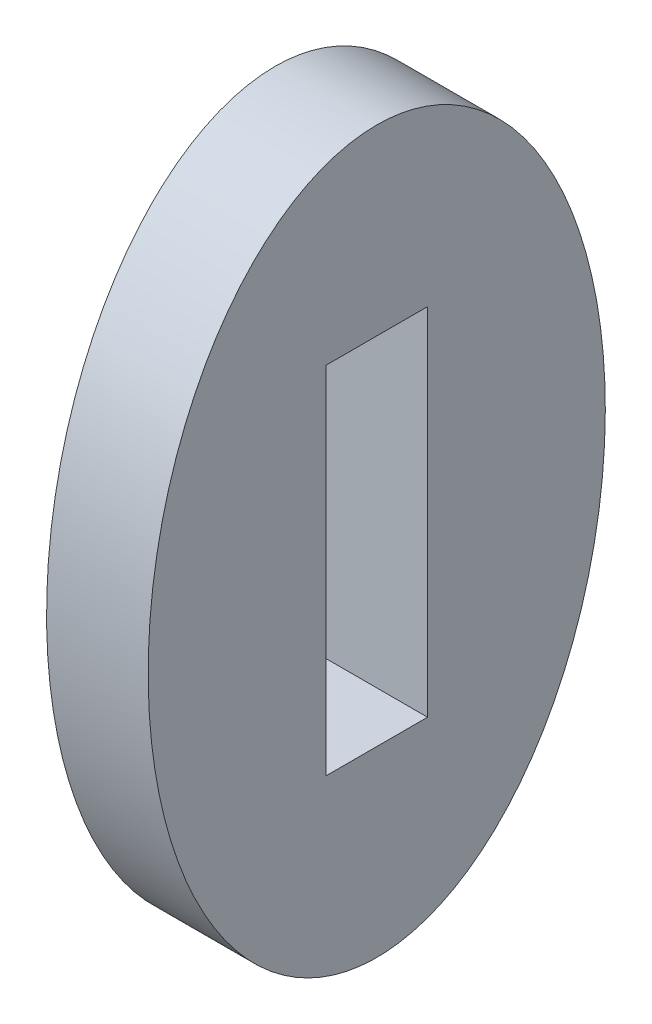
ISO-10303-21;
HEADER;
FILE_DESCRIPTION(('STEP AP214'),'2;1');
FILE_NAME('part.step','',(''),(''),'','','');
FILE_SCHEMA(('AUTOMOTIVE_DESIGN { 1 0 10303 214 1 1 1 1 }'));
ENDSEC;
DATA;
#1=APPLICATION_CONTEXT('core data for automotive mechanical design processes');
#2=APPLICATION_PROTOCOL_DEFINITION('international standard','automotive_design',2000,#1);
#3=PRODUCT_CONTEXT('',#1,'mechanical');
#4=PRODUCT('Part','Part','',(#3));
#5=PRODUCT_RELATED_PRODUCT_CATEGORY('part','',(#4));
#6=PRODUCT_DEFINITION_FORMATION('','',#4);
#7=PRODUCT_DEFINITION_CONTEXT('part definition',#1,'design');
#8=PRODUCT_DEFINITION('design','',#6,#7);
#9=PRODUCT_DEFINITION_SHAPE('','',#8);
#10=(LENGTH_UNIT() NAMED_UNIT(*) SI_UNIT(.MILLI.,.METRE.));
#11=(NAMED_UNIT(*) PLANE_ANGLE_UNIT() SI_UNIT($,.RADIAN.));
#12=(NAMED_UNIT(*) SI_UNIT($,.STERADIAN.) SOLID_ANGLE_UNIT());
#13=UNCERTAINTY_MEASURE_WITH_UNIT(LENGTH_MEASURE(1.E-05),#10,'distance_accuracy_value','');
#14=(GEOMETRIC_REPRESENTATION_CONTEXT(3) GLOBAL_UNCERTAINTY_ASSIGNED_CONTEXT((#13)) GLOBAL_UNIT_ASSIGNED_CONTEXT((#10,
#11,#12)) REPRESENTATION_CONTEXT('',''));
#15=CARTESIAN_POINT('',(0.,0.,0.));
#16=DIRECTION('',(0.,0.,1.));
#17=DIRECTION('',(1.,0.,0.));
#18=AXIS2_PLACEMENT_3D('',#15,#16,#17);
#19=CARTESIAN_POINT('',(6.35,0.,0.));
#20=DIRECTION('',(1.,0.,0.));
#21=DIRECTION('',(0.,0.,-1.));
#22=AXIS2_PLACEMENT_3D('',#19,#20,#21);
#23=PLANE('',#22);
#24=CARTESIAN_POINT('',(6.35,0.,0.));
#25=DIRECTION('',(1.,0.,0.));
#26=DIRECTION('',(0.,1.,0.));
#27=AXIS2_PLACEMENT_3D('',#24,#25,#26);
#28=ELLIPSE('',#27,22.536539576696,14.2875);
#29=CARTESIAN_POINT('',(6.35,22.536539576696,0.));
#30=VERTEX_POINT('',#29);
#31=EDGE_CURVE('E11',#30,#30,#28,.T.);
#32=ORIENTED_EDGE('',*,*,#31,.T.);
#33=EDGE_LOOP('',(#32));
#34=FACE_BOUND('',#33,.T.);
#35=DIRECTION('',(0.,0.,1.));
#36=VECTOR('',#35,1.);
#37=CARTESIAN_POINT('',(6.35,11.1125,3.175));
#38=LINE('',#37,#36);
#39=CARTESIAN_POINT('',(6.35,11.1125,-3.175));
#40=VERTEX_POINT('',#39);
#41=CARTESIAN_POINT('',(6.35,11.1125,3.175));
#42=VERTEX_POINT('',#41);
#43=EDGE_CURVE('E86',#40,#42,#38,.T.);
#44=ORIENTED_EDGE('',*,*,#43,.F.);
#45=DIRECTION('',(0.,1.,0.));
#46=VECTOR('',#45,1.);
#47=CARTESIAN_POINT('',(6.35,-11.1125,-3.175));
#48=LINE('',#47,#46);
#49=CARTESIAN_POINT('',(6.35,-11.1125,-3.175));
#50=VERTEX_POINT('',#49);
#51=EDGE_CURVE('E78',#50,#40,#48,.T.);
#52=ORIENTED_EDGE('',*,*,#51,.F.);
#53=DIRECTION('',(0.,0.,-1.));
#54=VECTOR('',#53,1.);
#55=CARTESIAN_POINT('',(6.35,-11.1125,3.175));
#56=LINE('',#55,#54);
#57=CARTESIAN_POINT('',(6.35,-11.1125,3.175));
#58=VERTEX_POINT('',#57);
#59=EDGE_CURVE('E99',#58,#50,#56,.T.);
#60=ORIENTED_EDGE('',*,*,#59,.F.);
#61=DIRECTION('',(0.,-1.,0.));
#62=VECTOR('',#61,1.);
#63=CARTESIAN_POINT('',(6.35,-11.1125,3.175));
#64=LINE('',#63,#62);
#65=EDGE_CURVE('E97',#42,#58,#64,.T.);
#66=ORIENTED_EDGE('',*,*,#65,.F.);
#67=EDGE_LOOP('',(#44,#52,#60,#66));
#68=FACE_BOUND('',#67,.T.);
#69=ADVANCED_FACE('F37',(#34,#68),#23,.T.);
#70=CARTESIAN_POINT('',(0.,0.,0.));
#71=DIRECTION('',(1.,0.,0.));
#72=DIRECTION('',(0.,0.,-1.));
#73=AXIS2_PLACEMENT_3D('',#70,#71,#72);
#74=PLANE('',#73);
#75=CARTESIAN_POINT('',(0.,0.,0.));
#76=DIRECTION('',(1.,0.,0.));
#77=DIRECTION('',(0.,1.,0.));
#78=AXIS2_PLACEMENT_3D('',#75,#76,#77);
#79=ELLIPSE('',#78,22.536539576696,14.2875);
#80=CARTESIAN_POINT('',(0.,22.536539576696,0.));
#81=VERTEX_POINT('',#80);
#82=EDGE_CURVE('E42',#81,#81,#79,.T.);
#83=ORIENTED_EDGE('',*,*,#82,.F.);
#84=EDGE_LOOP('',(#83));
#85=FACE_BOUND('',#84,.T.);
#86=DIRECTION('',(0.,1.,0.));
#87=VECTOR('',#86,1.);
#88=CARTESIAN_POINT('',(0.,-11.1125,-3.175));
#89=LINE('',#88,#87);
#90=CARTESIAN_POINT('',(0.,-11.1125,-3.175));
#91=VERTEX_POINT('',#90);
#92=CARTESIAN_POINT('',(0.,11.1125,-3.175));
#93=VERTEX_POINT('',#92);
#94=EDGE_CURVE('E60',#91,#93,#89,.T.);
#95=ORIENTED_EDGE('',*,*,#94,.T.);
#96=DIRECTION('',(0.,0.,1.));
#97=VECTOR('',#96,1.);
#98=CARTESIAN_POINT('',(0.,11.1125,3.175));
#99=LINE('',#98,#97);
#100=CARTESIAN_POINT('',(0.,11.1125,3.175));
#101=VERTEX_POINT('',#100);
#102=EDGE_CURVE('E93',#93,#101,#99,.T.);
#103=ORIENTED_EDGE('',*,*,#102,.T.);
#104=DIRECTION('',(0.,-1.,0.));
#105=VECTOR('',#104,1.);
#106=CARTESIAN_POINT('',(0.,-11.1125,3.175));
#107=LINE('',#106,#105);
#108=CARTESIAN_POINT('',(0.,-11.1125,3.175));
#109=VERTEX_POINT('',#108);
#110=EDGE_CURVE('E105',#101,#109,#107,.T.);
#111=ORIENTED_EDGE('',*,*,#110,.T.);
#112=DIRECTION('',(0.,0.,-1.));
#113=VECTOR('',#112,1.);
#114=CARTESIAN_POINT('',(0.,-11.1125,3.175));
#115=LINE('',#114,#113);
#116=EDGE_CURVE('E87',#109,#91,#115,.T.);
#117=ORIENTED_EDGE('',*,*,#116,.T.);
#118=EDGE_LOOP('',(#95,#103,#111,#117));
#119=FACE_BOUND('',#118,.T.);
#120=ADVANCED_FACE('F117',(#85,#119),#74,.F.);
#121=DIRECTION('',(-1.,0.,0.));
#122=VECTOR('',#121,1.);
#123=SURFACE_OF_LINEAR_EXTRUSION('',#28,#122);
#124=ORIENTED_EDGE('',*,*,#31,.F.);
#125=EDGE_LOOP('',(#124));
#126=FACE_BOUND('',#125,.T.);
#127=ORIENTED_EDGE('',*,*,#82,.T.);
#128=EDGE_LOOP('',(#127));
#129=FACE_BOUND('',#128,.T.);
#130=ADVANCED_FACE('F39',(#126,#129),#123,.F.);
#131=CARTESIAN_POINT('',(6.35,-11.1125,-3.175));
#132=DIRECTION('',(0.,0.,1.));
#133=DIRECTION('',(1.,0.,0.));
#134=AXIS2_PLACEMENT_3D('',#131,#132,#133);
#135=PLANE('',#134);
#136=ORIENTED_EDGE('',*,*,#94,.F.);
#137=DIRECTION('',(-1.,0.,0.));
#138=VECTOR('',#137,1.);
#139=CARTESIAN_POINT('',(6.35,-11.1125,-3.175));
#140=LINE('',#139,#138);
#141=EDGE_CURVE('E82',#50,#91,#140,.T.);
#142=ORIENTED_EDGE('',*,*,#141,.F.);
#143=ORIENTED_EDGE('',*,*,#51,.T.);
#144=DIRECTION('',(-1.,0.,0.));
#145=VECTOR('',#144,1.);
#146=CARTESIAN_POINT('',(6.35,11.1125,-3.175));
#147=LINE('',#146,#145);
#148=EDGE_CURVE('E81',#40,#93,#147,.T.);
#149=ORIENTED_EDGE('',*,*,#148,.T.);
#150=EDGE_LOOP('',(#136,#142,#143,#149));
#151=FACE_BOUND('',#150,.T.);
#152=ADVANCED_FACE('F80',(#151),#135,.T.);
#153=CARTESIAN_POINT('',(6.35,11.1125,3.175));
#154=DIRECTION('',(0.,-1.,0.));
#155=DIRECTION('',(0.,0.,-1.));
#156=AXIS2_PLACEMENT_3D('',#153,#154,#155);
#157=PLANE('',#156);
#158=ORIENTED_EDGE('',*,*,#102,.F.);
#159=ORIENTED_EDGE('',*,*,#148,.F.);
#160=ORIENTED_EDGE('',*,*,#43,.T.);
#161=DIRECTION('',(-1.,0.,0.));
#162=VECTOR('',#161,1.);
#163=CARTESIAN_POINT('',(6.35,11.1125,3.175));
#164=LINE('',#163,#162);
#165=EDGE_CURVE('E94',#42,#101,#164,.T.);
#166=ORIENTED_EDGE('',*,*,#165,.T.);
#167=EDGE_LOOP('',(#158,#159,#160,#166));
#168=FACE_BOUND('',#167,.T.);
#169=ADVANCED_FACE('F90',(#168),#157,.T.);
#170=CARTESIAN_POINT('',(6.35,-11.1125,3.175));
#171=DIRECTION('',(0.,0.,-1.));
#172=DIRECTION('',(-1.,0.,0.));
#173=AXIS2_PLACEMENT_3D('',#170,#171,#172);
#174=PLANE('',#173);
#175=ORIENTED_EDGE('',*,*,#110,.F.);
#176=ORIENTED_EDGE('',*,*,#165,.F.);
#177=ORIENTED_EDGE('',*,*,#65,.T.);
#178=DIRECTION('',(-1.,0.,0.));
#179=VECTOR('',#178,1.);
#180=CARTESIAN_POINT('',(6.35,-11.1125,3.175));
#181=LINE('',#180,#179);
#182=EDGE_CURVE('E52',#58,#109,#181,.T.);
#183=ORIENTED_EDGE('',*,*,#182,.T.);
#184=EDGE_LOOP('',(#175,#176,#177,#183));
#185=FACE_BOUND('',#184,.T.);
#186=ADVANCED_FACE('F115',(#185),#174,.T.);
#187=CARTESIAN_POINT('',(6.35,-11.1125,3.175));
#188=DIRECTION('',(0.,1.,0.));
#189=DIRECTION('',(0.,0.,1.));
#190=AXIS2_PLACEMENT_3D('',#187,#188,#189);
#191=PLANE('',#190);
#192=ORIENTED_EDGE('',*,*,#116,.F.);
#193=ORIENTED_EDGE('',*,*,#182,.F.);
#194=ORIENTED_EDGE('',*,*,#59,.T.);
#195=ORIENTED_EDGE('',*,*,#141,.T.);
#196=EDGE_LOOP('',(#192,#193,#194,#195));
#197=FACE_BOUND('',#196,.T.);
#198=ADVANCED_FACE('F118',(#197),#191,.T.);
#199=CLOSED_SHELL('',(#69,#120,#130,#152,#169,#186,#198));
#200=MANIFOLD_SOLID_BREP('B2',#199);
#201=ADVANCED_BREP_SHAPE_REPRESENTATION('',(#18,#200),#14);
#202=SHAPE_DEFINITION_REPRESENTATION(#9,#201);
ENDSEC;
END-ISO-10303-21;
